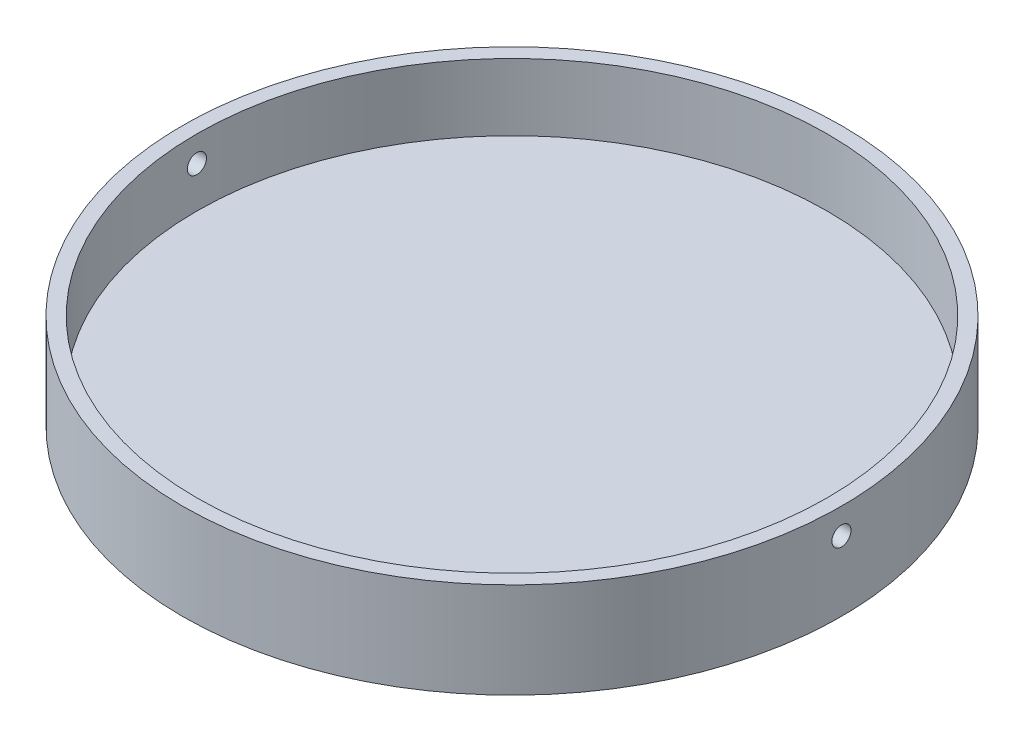
ISO-10303-21;
HEADER;
FILE_DESCRIPTION(('STEP AP214'),'2;1');
FILE_NAME('part.step','',(''),(''),'','','');
FILE_SCHEMA(('AUTOMOTIVE_DESIGN { 1 0 10303 214 1 1 1 1 }'));
ENDSEC;
DATA;
#1=APPLICATION_CONTEXT('core data for automotive mechanical design processes');
#2=APPLICATION_PROTOCOL_DEFINITION('international standard','automotive_design',2000,#1);
#3=PRODUCT_CONTEXT('',#1,'mechanical');
#4=PRODUCT('Part','Part','',(#3));
#5=PRODUCT_RELATED_PRODUCT_CATEGORY('part','',(#4));
#6=PRODUCT_DEFINITION_FORMATION('','',#4);
#7=PRODUCT_DEFINITION_CONTEXT('part definition',#1,'design');
#8=PRODUCT_DEFINITION('design','',#6,#7);
#9=PRODUCT_DEFINITION_SHAPE('','',#8);
#10=(LENGTH_UNIT() NAMED_UNIT(*) SI_UNIT(.MILLI.,.METRE.));
#11=(NAMED_UNIT(*) PLANE_ANGLE_UNIT() SI_UNIT($,.RADIAN.));
#12=(NAMED_UNIT(*) SI_UNIT($,.STERADIAN.) SOLID_ANGLE_UNIT());
#13=UNCERTAINTY_MEASURE_WITH_UNIT(LENGTH_MEASURE(1.E-05),#10,'distance_accuracy_value','');
#14=(GEOMETRIC_REPRESENTATION_CONTEXT(3) GLOBAL_UNCERTAINTY_ASSIGNED_CONTEXT((#13)) GLOBAL_UNIT_ASSIGNED_CONTEXT((#10,
#11,#12)) REPRESENTATION_CONTEXT('',''));
#15=CARTESIAN_POINT('',(0.,0.,0.));
#16=DIRECTION('',(0.,0.,1.));
#17=DIRECTION('',(1.,0.,0.));
#18=AXIS2_PLACEMENT_3D('',#15,#16,#17);
#19=CARTESIAN_POINT('',(0.,10.,0.));
#20=DIRECTION('',(0.,-1.,0.));
#21=DIRECTION('',(0.,0.,-1.));
#22=AXIS2_PLACEMENT_3D('',#19,#20,#21);
#23=CYLINDRICAL_SURFACE('',#22,34.5);
#24=CARTESIAN_POINT('',(0.,10.,0.));
#25=DIRECTION('',(0.,1.,0.));
#26=DIRECTION('',(0.,0.,1.));
#27=AXIS2_PLACEMENT_3D('',#24,#25,#26);
#28=CIRCLE('',#27,34.5);
#29=CARTESIAN_POINT('',(0.,10.,34.5));
#30=VERTEX_POINT('',#29);
#31=EDGE_CURVE('E10',#30,#30,#28,.T.);
#32=ORIENTED_EDGE('',*,*,#31,.F.);
#33=EDGE_LOOP('',(#32));
#34=FACE_BOUND('',#33,.T.);
#35=CARTESIAN_POINT('',(0.,0.,0.));
#36=DIRECTION('',(0.,1.,0.));
#37=DIRECTION('',(0.,0.,1.));
#38=AXIS2_PLACEMENT_3D('',#35,#36,#37);
#39=CIRCLE('',#38,34.5);
#40=CARTESIAN_POINT('',(0.,0.,34.5));
#41=VERTEX_POINT('',#40);
#42=EDGE_CURVE('E47',#41,#41,#39,.T.);
#43=ORIENTED_EDGE('',*,*,#42,.T.);
#44=EDGE_LOOP('',(#43));
#45=FACE_BOUND('',#44,.T.);
#46=CARTESIAN_POINT('',(34.5,6.30000000000002,0.));
#47=CARTESIAN_POINT('',(34.4999998046945,6.30000248649187,-0.0561577845511465));
#48=CARTESIAN_POINT('',(34.4998614117132,6.30474642336289,-0.112355988488296));
#49=CARTESIAN_POINT('',(34.4993226388949,6.32360461180538,-0.223203800673478));
#50=CARTESIAN_POINT('',(34.4989219459619,6.33773006197835,-0.277851476685632));
#51=CARTESIAN_POINT('',(34.4979039516065,6.37494804146932,-0.38397634150455));
#52=CARTESIAN_POINT('',(34.4972867559949,6.39803619105604,-0.435455064645263));
#53=CARTESIAN_POINT('',(34.4959053786316,6.4525179175079,-0.53379158758923));
#54=CARTESIAN_POINT('',(34.495141232818,6.48390946439989,-0.580650512979203));
#55=CARTESIAN_POINT('',(34.4935516278935,6.55412298566468,-0.6684521142079));
#56=CARTESIAN_POINT('',(34.4927261463915,6.59294768178979,-0.709392613264135));
#57=CARTESIAN_POINT('',(34.4911071048998,6.67692073158166,-0.784176923872428));
#58=CARTESIAN_POINT('',(34.4903135461813,6.72206933674449,-0.818020453050759));
#59=CARTESIAN_POINT('',(34.4888477313474,6.81741637750982,-0.877653292042605));
#60=CARTESIAN_POINT('',(34.4881754943653,6.86761560769315,-0.903441331912479));
#61=CARTESIAN_POINT('',(34.4870283277185,6.97163325402746,-0.946222882372556));
#62=CARTESIAN_POINT('',(34.4865533972886,7.02545165614172,-0.963216427069379));
#63=CARTESIAN_POINT('',(34.4858545550434,7.1351638378897,-0.987922024237621));
#64=CARTESIAN_POINT('',(34.485630572269,7.19105702622539,-0.995636700495366));
#65=CARTESIAN_POINT('',(34.4854586667784,7.30334555156083,-1.00157365007413));
#66=CARTESIAN_POINT('',(34.4855107430004,7.35974088662834,-0.999795959905588));
#67=CARTESIAN_POINT('',(34.4858850168782,7.47141504675166,-0.986800862487214));
#68=CARTESIAN_POINT('',(34.4862071333257,7.52669420235532,-0.975586293158666));
#69=CARTESIAN_POINT('',(34.4870850474834,7.63458492146474,-0.944040166641229));
#70=CARTESIAN_POINT('',(34.4876408456903,7.68719647930073,-0.923708590075785));
#71=CARTESIAN_POINT('',(34.488923561906,7.78826766974962,-0.874502332981568));
#72=CARTESIAN_POINT('',(34.4896505059684,7.83672666868263,-0.845626351561111));
#73=CARTESIAN_POINT('',(34.4911935375142,7.92811020750982,-0.780151939554365));
#74=CARTESIAN_POINT('',(34.4920096251853,7.97103473574799,-0.74355349270439));
#75=CARTESIAN_POINT('',(34.4936393074267,8.05014739777088,-0.663656990410169));
#76=CARTESIAN_POINT('',(34.4944529009686,8.08633304585002,-0.62035647357953));
#77=CARTESIAN_POINT('',(34.4959855877378,8.15092162658219,-0.52829366358104));
#78=CARTESIAN_POINT('',(34.49670468095,8.17932455799251,-0.479531369541086));
#79=CARTESIAN_POINT('',(34.4979673143515,8.22754116455228,-0.377927819396129));
#80=CARTESIAN_POINT('',(34.4985108529508,8.24735476191287,-0.325086526354983));
#81=CARTESIAN_POINT('',(34.4993610799481,8.2778286756748,-0.21682558057597));
#82=CARTESIAN_POINT('',(34.4996677689487,8.28848901536249,-0.161405934397941));
#83=CARTESIAN_POINT('',(34.5000096480394,8.30035075893756,-0.0495830524630798));
#84=CARTESIAN_POINT('',(34.500044936846,8.30155560208144,0.00681981818250436));
#85=CARTESIAN_POINT('',(34.4998402990692,8.29448111337462,0.119027035379701));
#86=CARTESIAN_POINT('',(34.4996003727826,8.28620179175481,0.174831382576897));
#87=CARTESIAN_POINT('',(34.4988724091248,8.260396840784,0.284247874070394));
#88=CARTESIAN_POINT('',(34.4983844136463,8.24287277262259,0.337860386862064));
#89=CARTESIAN_POINT('',(34.4972153032426,8.19907736036927,0.44138264812218));
#90=CARTESIAN_POINT('',(34.496534187957,8.17280599995106,0.491292389679408));
#91=CARTESIAN_POINT('',(34.4950553247578,8.11225289783428,0.586008177135157));
#92=CARTESIAN_POINT('',(34.4942575431649,8.07796884129803,0.630812742592857));
#93=CARTESIAN_POINT('',(34.4926353717158,8.00236694731424,0.714031468813746));
#94=CARTESIAN_POINT('',(34.4918109817955,7.9610490929013,0.752445614162921));
#95=CARTESIAN_POINT('',(34.4902282491819,7.87253773503847,0.82180453692617));
#96=CARTESIAN_POINT('',(34.4894699261552,7.82534249211954,0.852747095051693));
#97=CARTESIAN_POINT('',(34.488105134619,7.72642494851932,0.906269317304904));
#98=CARTESIAN_POINT('',(34.4874986657796,7.67470265767701,0.928848999607708));
#99=CARTESIAN_POINT('',(34.4865061010906,7.56820758571198,0.965000629858153));
#100=CARTESIAN_POINT('',(34.4861199700853,7.51343529275906,0.978574014847635));
#101=CARTESIAN_POINT('',(34.4856115175684,7.40238807570962,0.996332463932852));
#102=CARTESIAN_POINT('',(34.4854891958718,7.34611315266714,1.00051753461394));
#103=CARTESIAN_POINT('',(34.4855221661644,7.23368035133098,0.999380387266016));
#104=CARTESIAN_POINT('',(34.4856773559069,7.17752243755813,0.994061670831818));
#105=CARTESIAN_POINT('',(34.4862476393613,7.06689698260672,0.974075126050981));
#106=CARTESIAN_POINT('',(34.486662733589,7.01242944478301,0.959407279150584));
#107=CARTESIAN_POINT('',(34.4877060172622,6.90672947354561,0.921139296053091));
#108=CARTESIAN_POINT('',(34.4883342103099,6.8554970948349,0.897539008865471));
#109=CARTESIAN_POINT('',(34.4897328468125,6.75772282262835,0.842077347897055));
#110=CARTESIAN_POINT('',(34.4905032850938,6.71118075862996,0.810216274563292));
#111=CARTESIAN_POINT('',(34.4920998413686,6.6240923518436,0.739127423656141));
#112=CARTESIAN_POINT('',(34.4929259738919,6.58354758253188,0.699897718922836));
#113=CARTESIAN_POINT('',(34.4945408498475,6.50960844468429,0.615176895547693));
#114=CARTESIAN_POINT('',(34.4953295839687,6.47621584961193,0.569684228515873));
#115=CARTESIAN_POINT('',(34.496781015048,6.41752364536506,0.473711713627784));
#116=CARTESIAN_POINT('',(34.497443631422,6.39222920358373,0.42322870823813));
#117=CARTESIAN_POINT('',(34.4985666770347,6.35050439933714,0.318769636078153));
#118=CARTESIAN_POINT('',(34.4990273473385,6.33406346296609,0.264797822771157));
#119=CARTESIAN_POINT('',(34.4995714248457,6.31487101549548,0.175404064473235));
#120=CARTESIAN_POINT('',(34.4997314435224,6.30930139780287,0.140562398656607));
#121=CARTESIAN_POINT('',(34.4999457923827,6.30186511016429,0.070485797185735));
#122=CARTESIAN_POINT('',(34.5000001225954,6.29999843920162,0.0352508616394729));
#123=CARTESIAN_POINT('',(34.5,6.30000000000002,0.));
#124=B_SPLINE_CURVE_WITH_KNOTS('',3,(#46,#47,#48,#49,#50,#51,#52,#53,#54,#55,#56,#57,#58,#59,
#60,#61,#62,#63,#64,#65,#66,#67,#68,#69,#70,#71,#72,#73,#74,#75,#76,#77,#78,#79,#80,#81,#82,#83,
#84,#85,#86,#87,#88,#89,#90,#91,#92,#93,#94,#95,#96,#97,#98,#99,#100,#101,#102,#103,#104,#105,
#106,#107,#108,#109,#110,#111,#112,#113,#114,#115,#116,#117,#118,#119,#120,#121,#122,#123),
.UNSPECIFIED.,.T.,.F.,(4,2,2,2,2,2,2,2,2,2,2,2,2,2,2,2,2,2,2,2,2,2,2,2,2,2,2,2,2,2,2,2,2,2,2,2,
2,2,4),(0.,0.168344683735104,0.336890680567464,0.505354418831559,0.673777009926029,
0.842261389681646,1.01075247181021,1.17927010307896,1.3477870808014,1.51625639575398,
1.68472506272425,1.85314308477081,2.02156146476122,2.19000549977429,2.35844988953782,
2.52695628922152,2.6954627158113,2.86397066843907,3.03247819237284,3.20092442206684,
3.36937047005223,3.53778808112234,3.70620600653575,3.87467264752724,4.04313969486281,
4.2116567206476,4.3801733801906,4.54866314480069,4.71715279122499,4.88558037177809,
5.05400828658412,5.22243904855781,5.39086368551809,5.55933243301633,5.72784290603201,
5.89646069145883,6.06487664436631,6.17054849076994,6.27622030815943),.UNSPECIFIED.);
#125=CARTESIAN_POINT('',(34.5,6.30000000000002,0.));
#126=VERTEX_POINT('',#125);
#127=EDGE_CURVE('E82',#126,#126,#124,.T.);
#128=ORIENTED_EDGE('',*,*,#127,.F.);
#129=EDGE_LOOP('',(#128));
#130=FACE_BOUND('',#129,.T.);
#131=CARTESIAN_POINT('',(-34.4855042010408,7.30000000000002,1.));
#132=CARTESIAN_POINT('',(-34.4855043966615,7.35615777896248,0.999997513503064));
#133=CARTESIAN_POINT('',(-34.4856428493906,7.41235597733022,0.995253577544319));
#134=CARTESIAN_POINT('',(-34.4861818354653,7.52320377794335,0.97639539305499));
#135=CARTESIAN_POINT('',(-34.4865826820198,7.5778514479485,0.962269945904057));
#136=CARTESIAN_POINT('',(-34.4876010099077,7.68397630007032,0.925051975255354));
#137=CARTESIAN_POINT('',(-34.488218385414,7.73545501657182,0.901963831633155));
#138=CARTESIAN_POINT('',(-34.4896000699939,7.83379152841197,0.847482119223123));
#139=CARTESIAN_POINT('',(-34.4903643431426,7.8806504493289,0.816090580393597));
#140=CARTESIAN_POINT('',(-34.4919540947383,7.96845205569152,0.745877067238504));
#141=CARTESIAN_POINT('',(-34.4927795955512,8.00939256291806,0.707052369362862));
#142=CARTESIAN_POINT('',(-34.4943985588806,8.08417688927162,0.623079312650367));
#143=CARTESIAN_POINT('',(-34.4951920201214,8.11802042604993,0.577930702339597));
#144=CARTESIAN_POINT('',(-34.4966575658427,8.17765327292448,0.482583657146451));
#145=CARTESIAN_POINT('',(-34.4973296311994,8.20344131449091,0.432384428567677));
#146=CARTESIAN_POINT('',(-34.4984764557693,8.24622286853152,0.32836678572263));
#147=CARTESIAN_POINT('',(-34.4989512157472,8.26321641509164,0.274548385484554));
#148=CARTESIAN_POINT('',(-34.4996497931078,8.28792201624922,0.164836209146201));
#149=CARTESIAN_POINT('',(-34.4998736814319,8.29563669476316,0.108943024373051));
#150=CARTESIAN_POINT('',(-34.500045515344,8.30157365008834,-0.0033454940118148));
#151=CARTESIAN_POINT('',(-34.4999934619926,8.29979596338633,-0.0597408256925462));
#152=CARTESIAN_POINT('',(-34.4996193411484,8.28680087138632,-0.17141500129149));
#153=CARTESIAN_POINT('',(-34.499297354732,8.27558630052198,-0.226694175350868));
#154=CARTESIAN_POINT('',(-34.498419750732,8.24404016450828,-0.334584930580967));
#155=CARTESIAN_POINT('',(-34.4978641326528,8.22370858001649,-0.387196506091914));
#156=CARTESIAN_POINT('',(-34.4965817481125,8.1745023066555,-0.488267717694181));
#157=CARTESIAN_POINT('',(-34.4958549556308,8.14562631876796,-0.536726721018085));
#158=CARTESIAN_POINT('',(-34.4943121321187,8.08015189303604,-0.628110265870448));
#159=CARTESIAN_POINT('',(-34.4934961009003,8.04355343892378,-0.671034795739863));
#160=CARTESIAN_POINT('',(-34.4918664119504,7.96365693156341,-0.750147449298961));
#161=CARTESIAN_POINT('',(-34.4910527552027,7.92035641838948,-0.786333088756667));
#162=CARTESIAN_POINT('',(-34.4895198497781,7.82829361874798,-0.850921653848826));
#163=CARTESIAN_POINT('',(-34.4888006011164,7.77953133139624,-0.879324578223405));
#164=CARTESIAN_POINT('',(-34.4875376326048,7.67792778287988,-0.927541179752248));
#165=CARTESIAN_POINT('',(-34.4869939143894,7.62508648373253,-0.947354776913501));
#166=CARTESIAN_POINT('',(-34.4861433828903,7.51682552470884,-0.977828688397576));
#167=CARTESIAN_POINT('',(-34.4858365690029,7.46140587140247,-0.988489026042695));
#168=CARTESIAN_POINT('',(-34.4854945497825,7.34958298644503,-1.00035076194403));
#169=CARTESIAN_POINT('',(-34.4854592456373,7.29318012011198,-1.00155560140443));
#170=CARTESIAN_POINT('',(-34.4856639688218,7.1809729124311,-0.994481106870726));
#171=CARTESIAN_POINT('',(-34.4859039958546,7.12516857043772,-0.986201783107063));
#172=CARTESIAN_POINT('',(-34.4866322329101,7.01575210334837,-0.960396833025402));
#173=CARTESIAN_POINT('',(-34.4871204009699,6.9621396092462,-0.942872770060039));
#174=CARTESIAN_POINT('',(-34.4882898527511,6.85861738305792,-0.899077374476204));
#175=CARTESIAN_POINT('',(-34.4889711368336,6.80870765789587,-0.872806025501125));
#176=CARTESIAN_POINT('',(-34.4904502602827,6.71399188115795,-0.812252939968673));
#177=CARTESIAN_POINT('',(-34.4912481333486,6.66918731188499,-0.777968885661196));
#178=CARTESIAN_POINT('',(-34.4928703700141,6.58596857692419,-0.702366993994283));
#179=CARTESIAN_POINT('',(-34.4936947336776,6.54755442663419,-0.661049139687255));
#180=CARTESIAN_POINT('',(-34.4952773075883,6.47819549383851,-0.572537779576498));
#181=CARTESIAN_POINT('',(-34.4960354981375,6.44725293062158,-0.525342534302819));
#182=CARTESIAN_POINT('',(-34.4973999764848,6.39373069942092,-0.426424984696161));
#183=CARTESIAN_POINT('',(-34.498006264613,6.37115101326211,-0.374702690202134));
#184=CARTESIAN_POINT('',(-34.4989984988728,6.33499938031514,-0.268207621065989));
#185=CARTESIAN_POINT('',(-34.4993844801959,6.32142599481887,-0.213435335159568));
#186=CARTESIAN_POINT('',(-34.4998927300556,6.30366754233012,-0.102388132919097));
#187=CARTESIAN_POINT('',(-34.5000149987761,6.29948246878951,-0.046113217633124));
#188=CARTESIAN_POINT('',(-34.4999820425492,6.30061960807283,0.0663195891326281));
#189=CARTESIAN_POINT('',(-34.4998269197054,6.30593832269522,0.122477516056885));
#190=CARTESIAN_POINT('',(-34.4992568604314,6.32592486849218,0.233102997746688));
#191=CARTESIAN_POINT('',(-34.4988419234863,6.34059271819682,0.287570549161669));
#192=CARTESIAN_POINT('',(-34.4977989759251,6.3788607117224,0.393270546659575));
#193=CARTESIAN_POINT('',(-34.4971709617078,6.40246100651514,0.444502938046334));
#194=CARTESIAN_POINT('',(-34.4957726260003,6.45792268659465,0.542277232411385));
#195=CARTESIAN_POINT('',(-34.4950023096864,6.48978377142078,0.588819305899976));
#196=CARTESIAN_POINT('',(-34.4934058874433,6.56087263466112,0.675907711399699));
#197=CARTESIAN_POINT('',(-34.4925797669753,6.60010233762951,0.716452472061236));
#198=CARTESIAN_POINT('',(-34.490964799574,6.68482315395909,0.790391593284049));
#199=CARTESIAN_POINT('',(-34.4901759619232,6.73031581572885,0.823784180359634));
#200=CARTESIAN_POINT('',(-34.4887242534084,6.82628832664579,0.882476376347583));
#201=CARTESIAN_POINT('',(-34.4880614631077,6.8767713342606,0.90777081633666));
#202=CARTESIAN_POINT('',(-34.48693807595,6.9812304111986,0.9494956166088));
#203=CARTESIAN_POINT('',(-34.48647723802,7.03520222704638,0.965936550826577));
#204=CARTESIAN_POINT('',(-34.4859329520411,7.12459597955062,0.985128992009054));
#205=CARTESIAN_POINT('',(-34.4857728685457,7.15943763658893,0.990698606879123));
#206=CARTESIAN_POINT('',(-34.4855584316634,7.22951422045825,0.998134890766206));
#207=CARTESIAN_POINT('',(-34.4855040782475,7.26474914718113,1.00000156080136));
#208=CARTESIAN_POINT('',(-34.4855042010408,7.30000000000002,1.));
#209=B_SPLINE_CURVE_WITH_KNOTS('',3,(#131,#132,#133,#134,#135,#136,#137,#138,#139,#140,#141,
#142,#143,#144,#145,#146,#147,#148,#149,#150,#151,#152,#153,#154,#155,#156,#157,#158,#159,#160,
#161,#162,#163,#164,#165,#166,#167,#168,#169,#170,#171,#172,#173,#174,#175,#176,#177,#178,#179,
#180,#181,#182,#183,#184,#185,#186,#187,#188,#189,#190,#191,#192,#193,#194,#195,#196,#197,#198,
#199,#200,#201,#202,#203,#204,#205,#206,#207,#208),.UNSPECIFIED.,.T.,.F.,(4,2,2,2,2,2,2,2,2,2,2,
2,2,2,2,2,2,2,2,2,2,2,2,2,2,2,2,2,2,2,2,2,2,2,2,2,2,2,4),(0.,0.168344666951775,
0.336890647365465,0.505354366485287,0.673776938730269,0.842261340438658,1.01075244392666,
1.17927006699606,1.34778703691533,1.51625634169998,1.68472499892274,1.85314307346897,
2.02156150532853,2.19000555525971,2.35844996003302,2.52695633794915,2.69546274314326,
2.86397071761571,3.03247826273241,3.20092447889963,3.36937051336653,3.53778807151075,
3.70620594458181,3.87467259452731,4.04313965039056,4.21165668471111,4.38017335279086,
4.5486630947539,4.71715271919924,4.88558033792177,5.05400829047055,5.22243908983314,
5.39086376390643,5.55933248888089,5.7278429398922,5.89646073509569,6.06487669722301,
6.17054851720683,6.27622030813588),.UNSPECIFIED.);
#210=CARTESIAN_POINT('',(-34.4855042010408,7.30000000000002,1.));
#211=VERTEX_POINT('',#210);
#212=EDGE_CURVE('E77',#211,#211,#209,.T.);
#213=ORIENTED_EDGE('',*,*,#212,.F.);
#214=EDGE_LOOP('',(#213));
#215=FACE_BOUND('',#214,.T.);
#216=ADVANCED_FACE('F35',(#34,#45,#130,#215),#23,.T.);
#217=CARTESIAN_POINT('',(0.,3.00000000000001,0.));
#218=DIRECTION('',(0.,1.,0.));
#219=DIRECTION('',(0.,0.,1.));
#220=AXIS2_PLACEMENT_3D('',#217,#218,#219);
#221=CYLINDRICAL_SURFACE('',#220,33.);
#222=CARTESIAN_POINT('',(0.,3.00000000000001,0.));
#223=DIRECTION('',(0.,1.,0.));
#224=DIRECTION('',(0.,0.,1.));
#225=AXIS2_PLACEMENT_3D('',#222,#223,#224);
#226=CIRCLE('',#225,33.);
#227=CARTESIAN_POINT('',(0.,3.00000000000001,33.));
#228=VERTEX_POINT('',#227);
#229=EDGE_CURVE('E52',#228,#228,#226,.T.);
#230=ORIENTED_EDGE('',*,*,#229,.F.);
#231=EDGE_LOOP('',(#230));
#232=FACE_BOUND('',#231,.T.);
#233=CARTESIAN_POINT('',(0.,10.,0.));
#234=DIRECTION('',(0.,1.,0.));
#235=DIRECTION('',(0.,0.,1.));
#236=AXIS2_PLACEMENT_3D('',#233,#234,#235);
#237=CIRCLE('',#236,33.);
#238=CARTESIAN_POINT('',(0.,10.,33.));
#239=VERTEX_POINT('',#238);
#240=EDGE_CURVE('E55',#239,#239,#237,.T.);
#241=ORIENTED_EDGE('',*,*,#240,.T.);
#242=EDGE_LOOP('',(#241));
#243=FACE_BOUND('',#242,.T.);
#244=CARTESIAN_POINT('',(-32.9848450049413,7.30000000000002,1.));
#245=CARTESIAN_POINT('',(-32.9848452094151,7.24384339825292,0.999997513916846));
#246=CARTESIAN_POINT('',(-32.984989955123,7.18764640587518,0.995253776058183));
#247=CARTESIAN_POINT('',(-32.985553437433,7.07680106479074,0.976396424324178));
#248=CARTESIAN_POINT('',(-32.9859725012603,7.02215464704196,0.96227161978723));
#249=CARTESIAN_POINT('',(-32.9870371050102,6.91603230583989,0.925055456478256));
#250=CARTESIAN_POINT('',(-32.9876825340706,6.86455484487384,0.901968486328517));
#251=CARTESIAN_POINT('',(-32.9891269996576,6.76622059517838,0.847489644729131));
#252=CARTESIAN_POINT('',(-32.9899259986878,6.71936268274141,0.816099799834387));
#253=CARTESIAN_POINT('',(-32.9915880050526,6.6315615674128,0.745889243499292));
#254=CARTESIAN_POINT('',(-32.992451037325,6.59062068740648,0.707065627568262));
#255=CARTESIAN_POINT('',(-32.9941436132942,6.51583534527425,0.623094670175425));
#256=CARTESIAN_POINT('',(-32.994973155656,6.48199116582775,0.57794707693314));
#257=CARTESIAN_POINT('',(-32.9965053674752,6.42235625474849,0.482601050206226));
#258=CARTESIAN_POINT('',(-32.9972080148601,6.3965669236343,0.432401740369788));
#259=CARTESIAN_POINT('',(-32.998407035057,6.35378288884311,0.328383501204769));
#260=CARTESIAN_POINT('',(-32.9989034087043,6.3367881495537,0.274564586534249));
#261=CARTESIAN_POINT('',(-32.9996337921232,6.31208073029941,0.164852473100316));
#262=CARTESIAN_POINT('',(-32.9998678829986,6.30436518094284,0.108959921079048));
#263=CARTESIAN_POINT('',(-33.0000475851029,6.29842631804303,-0.00332752322261688));
#264=CARTESIAN_POINT('',(-32.9999931974955,6.30020296621305,-0.0597224134759168));
#265=CARTESIAN_POINT('',(-32.999602142838,6.31319564237434,-0.171394249637361));
#266=CARTESIAN_POINT('',(-32.999265568437,6.32440857219892,-0.226671556376913));
#267=CARTESIAN_POINT('',(-32.9983481795469,6.35595072504194,-0.334558852911754));
#268=CARTESIAN_POINT('',(-32.9977673645154,6.37627996829927,-0.387168836785096));
#269=CARTESIAN_POINT('',(-32.9964267952727,6.42548122697416,-0.488238040766675));
#270=CARTESIAN_POINT('',(-32.9956670113311,6.45435466195565,-0.536696569410087));
#271=CARTESIAN_POINT('',(-32.9940541292464,6.51982363516501,-0.628079714022284));
#272=CARTESIAN_POINT('',(-32.993201030885,6.5564191914623,-0.67100431704155));
#273=CARTESIAN_POINT('',(-32.9914972555386,6.63631113021747,-0.750119200807011));
#274=CARTESIAN_POINT('',(-32.9906465796652,6.67961020121639,-0.786306766685399));
#275=CARTESIAN_POINT('',(-32.9890439003924,6.7716705811351,-0.850899438716022));
#276=CARTESIAN_POINT('',(-32.9882918970094,6.82043189095892,-0.879304543580198));
#277=CARTESIAN_POINT('',(-32.9869713806257,6.92203411368124,-0.927525677221475));
#278=CARTESIAN_POINT('',(-32.9864028695078,6.97487506843368,-0.947341617866715));
#279=CARTESIAN_POINT('',(-32.9855135199283,7.08313591855157,-0.977820170080306));
#280=CARTESIAN_POINT('',(-32.9851926807778,7.1385558067441,-0.988482807105594));
#281=CARTESIAN_POINT('',(-32.9848349761178,7.25037772812721,-1.00034874629295));
#282=CARTESIAN_POINT('',(-32.9847979976982,7.30677936186436,-1.00155580956432));
#283=CARTESIAN_POINT('',(-32.9850118894533,7.4189844723917,-0.994486138389986));
#284=CARTESIAN_POINT('',(-32.9852627592874,7.47478794988961,-0.986209415166506));
#285=CARTESIAN_POINT('',(-32.9860239641499,7.5842021866354,-0.960410233012218));
#286=CARTESIAN_POINT('',(-32.9865342512087,7.63781334929017,-0.942889483394619));
#287=CARTESIAN_POINT('',(-32.9877567251355,7.74133350930821,-0.89910133437196));
#288=CARTESIAN_POINT('',(-32.9884689124185,7.79124249906215,-0.872833916989885));
#289=CARTESIAN_POINT('',(-32.9900151778128,7.88595889683607,-0.812288379163003));
#290=CARTESIAN_POINT('',(-32.9908492944343,7.93076468507472,-0.77800772575758));
#291=CARTESIAN_POINT('',(-32.9925452517959,8.01398653388911,-0.702412538591519));
#292=CARTESIAN_POINT('',(-32.9934070926079,8.05240257787503,-0.661097986569185));
#293=CARTESIAN_POINT('',(-32.9950616715456,8.12176699374119,-0.572591666512515));
#294=CARTESIAN_POINT('',(-32.9958543871723,8.15271293998114,-0.525397996971732));
#295=CARTESIAN_POINT('',(-32.9972810356506,8.20624212879056,-0.426482807563423));
#296=CARTESIAN_POINT('',(-32.9979149688637,8.2288253903995,-0.374761298004851));
#297=CARTESIAN_POINT('',(-32.9989524843327,8.26498390147263,-0.268267757417567));
#298=CARTESIAN_POINT('',(-32.9993561067704,8.27856072233616,-0.213496260344184));
#299=CARTESIAN_POINT('',(-32.999887661619,8.29632610964994,-0.102449938949434));
#300=CARTESIAN_POINT('',(-33.0000155942863,8.30051468483106,-0.0461751160261765));
#301=CARTESIAN_POINT('',(-32.9999813508045,8.2993845006457,0.0662561625748287));
#302=CARTESIAN_POINT('',(-32.9998192912732,8.29406956302972,0.122412656745657));
#303=CARTESIAN_POINT('',(-32.9992235528111,8.27409108466653,0.233035883636807));
#304=CARTESIAN_POINT('',(-32.998789873343,8.25942752542208,0.287502613013525));
#305=CARTESIAN_POINT('',(-32.9976997432227,8.22116857937609,0.393201647748674));
#306=CARTESIAN_POINT('',(-32.9970432888647,8.19757304399322,0.444433899285776));
#307=CARTESIAN_POINT('',(-32.9955815732978,8.14212123853,0.54220879356863));
#308=CARTESIAN_POINT('',(-32.9947763174615,8.11026526668049,0.588751605535427));
#309=CARTESIAN_POINT('',(-32.9931074026415,8.03918555727258,0.675844039137156));
#310=CARTESIAN_POINT('',(-32.9922437264673,7.99995964498123,0.716391885441771));
#311=CARTESIAN_POINT('',(-32.9905552857636,7.91524584696166,0.790337856052523));
#312=CARTESIAN_POINT('',(-32.9897305309215,7.86975641318205,0.823734207611379));
#313=CARTESIAN_POINT('',(-32.9882126523462,7.77378883908226,0.882434983782636));
#314=CARTESIAN_POINT('',(-32.9875196147845,7.72330746555596,0.907734118414881));
#315=CARTESIAN_POINT('',(-32.9863448968476,7.61885060111022,0.949468459862879));
#316=CARTESIAN_POINT('',(-32.98586296459,7.56487936292557,0.96591423554956));
#317=CARTESIAN_POINT('',(-32.9852936137897,7.47547271891875,0.985117254893504));
#318=CARTESIAN_POINT('',(-32.9851261164718,7.44061762048011,0.990691260658938));
#319=CARTESIAN_POINT('',(-32.9849017478623,7.37051365728703,0.998133413249859));
#320=CARTESIAN_POINT('',(-32.9848448765374,7.33526479265119,1.00000156119146));
#321=CARTESIAN_POINT('',(-32.9848450049413,7.30000000000002,1.));
#322=B_SPLINE_CURVE_WITH_KNOTS('',3,(#244,#245,#246,#247,#248,#249,#250,#251,#252,#253,#254,
#255,#256,#257,#258,#259,#260,#261,#262,#263,#264,#265,#266,#267,#268,#269,#270,#271,#272,#273,
#274,#275,#276,#277,#278,#279,#280,#281,#282,#283,#284,#285,#286,#287,#288,#289,#290,#291,#292,
#293,#294,#295,#296,#297,#298,#299,#300,#301,#302,#303,#304,#305,#306,#307,#308,#309,#310,#311,
#312,#313,#314,#315,#316,#317,#318,#319,#320,#321),.UNSPECIFIED.,.T.,.F.,(4,2,2,2,2,2,2,2,2,2,2,
2,2,2,2,2,2,2,2,2,2,2,2,2,2,2,2,2,2,2,2,2,2,2,2,2,2,2,4),(0.,0.168341084003358,
0.336883343407829,0.505343174391838,0.673761925799804,0.842246615823596,1.01073801574169,
1.17925869543352,1.34777869272,1.51624656537945,1.68471375852474,1.85312566125722,
2.02153793787864,2.1899782108697,2.35841887800788,2.52692727654634,2.69543570297426,
2.86394585839576,3.03245554515955,3.20089820103071,3.36934065758267,3.53775197834513,
3.70616364524528,3.87462861874332,4.04309402962369,4.21161407010399,4.38013372690912,
4.54862397349753,4.71711406339367,4.88553641178359,5.05395909341607,5.22238457684377,
5.39080398036544,5.55927315960984,5.72778405159506,5.89640480950997,6.0648238241834,
6.17053740059808,6.2762509451745),.UNSPECIFIED.);
#323=CARTESIAN_POINT('',(-32.9848450049413,7.30000000000002,1.));
#324=VERTEX_POINT('',#323);
#325=EDGE_CURVE('E57',#324,#324,#322,.T.);
#326=ORIENTED_EDGE('',*,*,#325,.F.);
#327=EDGE_LOOP('',(#326));
#328=FACE_BOUND('',#327,.T.);
#329=CARTESIAN_POINT('',(32.9848450049413,7.30000000000002,1.));
#330=CARTESIAN_POINT('',(32.9848452094151,7.35615660174711,0.999997513916846));
#331=CARTESIAN_POINT('',(32.984989955123,7.41235359412485,0.995253776058183));
#332=CARTESIAN_POINT('',(32.985553437433,7.5231989352093,0.976396424324178));
#333=CARTESIAN_POINT('',(32.9859725012603,7.57784535295808,0.96227161978723));
#334=CARTESIAN_POINT('',(32.9870371050102,7.68396769416014,0.925055456478257));
#335=CARTESIAN_POINT('',(32.9876825340706,7.73544515512619,0.901968486328518));
#336=CARTESIAN_POINT('',(32.9891269996576,7.83377940482166,0.847489644729132));
#337=CARTESIAN_POINT('',(32.9899259986878,7.88063731725863,0.816099799834387));
#338=CARTESIAN_POINT('',(32.9915880050526,7.96843843258723,0.745889243499292));
#339=CARTESIAN_POINT('',(32.992451037325,8.00937931259355,0.707065627568263));
#340=CARTESIAN_POINT('',(32.9941436132942,8.08416465472578,0.623094670175425));
#341=CARTESIAN_POINT('',(32.994973155656,8.11800883417228,0.57794707693314));
#342=CARTESIAN_POINT('',(32.9965053674752,8.17764374525154,0.482601050206225));
#343=CARTESIAN_POINT('',(32.9972080148601,8.20343307636574,0.432401740369788));
#344=CARTESIAN_POINT('',(32.998407035057,8.24621711115692,0.328383501204769));
#345=CARTESIAN_POINT('',(32.9989034087043,8.26321185044633,0.274564586534249));
#346=CARTESIAN_POINT('',(32.9996337921232,8.28791926970062,0.164852473100317));
#347=CARTESIAN_POINT('',(32.9998678829986,8.29563481905719,0.108959921079048));
#348=CARTESIAN_POINT('',(33.0000475851029,8.301573681957,-0.00332752322261652));
#349=CARTESIAN_POINT('',(32.9999931974955,8.29979703378698,-0.0597224134759165));
#350=CARTESIAN_POINT('',(32.999602142838,8.28680435762569,-0.17139424963736));
#351=CARTESIAN_POINT('',(32.999265568437,8.27559142780111,-0.226671556376913));
#352=CARTESIAN_POINT('',(32.9983481795469,8.2440492749581,-0.334558852911754));
#353=CARTESIAN_POINT('',(32.9977673645154,8.22372003170077,-0.387168836785096));
#354=CARTESIAN_POINT('',(32.9964267952727,8.17451877302588,-0.488238040766675));
#355=CARTESIAN_POINT('',(32.9956670113311,8.14564533804438,-0.536696569410087));
#356=CARTESIAN_POINT('',(32.9940541292464,8.08017636483502,-0.628079714022284));
#357=CARTESIAN_POINT('',(32.993201030885,8.04358080853773,-0.67100431704155));
#358=CARTESIAN_POINT('',(32.9914972555386,7.96368886978256,-0.750119200807011));
#359=CARTESIAN_POINT('',(32.9906465796652,7.92038979878364,-0.786306766685399));
#360=CARTESIAN_POINT('',(32.9890439003924,7.82832941886494,-0.850899438716022));
#361=CARTESIAN_POINT('',(32.9882918970094,7.77956810904111,-0.879304543580198));
#362=CARTESIAN_POINT('',(32.9869713806257,7.6779658863188,-0.927525677221475));
#363=CARTESIAN_POINT('',(32.9864028695078,7.62512493156635,-0.947341617866715));
#364=CARTESIAN_POINT('',(32.9855135199283,7.51686408144847,-0.977820170080306));
#365=CARTESIAN_POINT('',(32.9851926807778,7.46144419325594,-0.988482807105594));
#366=CARTESIAN_POINT('',(32.9848349761178,7.34962227187283,-1.00034874629295));
#367=CARTESIAN_POINT('',(32.9847979976982,7.29322063813567,-1.00155580956432));
#368=CARTESIAN_POINT('',(32.9850118894533,7.18101552760834,-0.994486138389986));
#369=CARTESIAN_POINT('',(32.9852627592874,7.12521205011043,-0.986209415166506));
#370=CARTESIAN_POINT('',(32.9860239641499,7.01579781336464,-0.960410233012218));
#371=CARTESIAN_POINT('',(32.9865342512087,6.96218665070986,-0.942889483394619));
#372=CARTESIAN_POINT('',(32.9877567251355,6.85866649069182,-0.89910133437196));
#373=CARTESIAN_POINT('',(32.9884689124185,6.80875750093788,-0.872833916989885));
#374=CARTESIAN_POINT('',(32.9900151778128,6.71404110316396,-0.812288379163003));
#375=CARTESIAN_POINT('',(32.9908492944343,6.66923531492531,-0.77800772575758));
#376=CARTESIAN_POINT('',(32.9925452517959,6.58601346611092,-0.702412538591519));
#377=CARTESIAN_POINT('',(32.9934070926079,6.547597422125,-0.661097986569185));
#378=CARTESIAN_POINT('',(32.9950616715456,6.47823300625885,-0.572591666512515));
#379=CARTESIAN_POINT('',(32.9958543871723,6.44728706001889,-0.525397996971732));
#380=CARTESIAN_POINT('',(32.9972810356506,6.39375787120947,-0.426482807563424));
#381=CARTESIAN_POINT('',(32.9979149688637,6.37117460960053,-0.374761298004851));
#382=CARTESIAN_POINT('',(32.9989524843327,6.3350160985274,-0.268267757417567));
#383=CARTESIAN_POINT('',(32.9993561067704,6.32143927766388,-0.213496260344184));
#384=CARTESIAN_POINT('',(32.999887661619,6.30367389035009,-0.102449938949434));
#385=CARTESIAN_POINT('',(33.0000155942863,6.29948531516898,-0.0461751160261764));
#386=CARTESIAN_POINT('',(32.9999813508045,6.30061549935433,0.0662561625748286));
#387=CARTESIAN_POINT('',(32.9998192912732,6.30593043697031,0.122412656745657));
#388=CARTESIAN_POINT('',(32.9992235528111,6.3259089153335,0.233035883636807));
#389=CARTESIAN_POINT('',(32.998789873343,6.34057247457795,0.287502613013525));
#390=CARTESIAN_POINT('',(32.9976997432227,6.37883142062394,0.393201647748674));
#391=CARTESIAN_POINT('',(32.9970432888647,6.40242695600682,0.444433899285777));
#392=CARTESIAN_POINT('',(32.9955815732978,6.45787876147003,0.54220879356863));
#393=CARTESIAN_POINT('',(32.9947763174615,6.48973473331955,0.588751605535427));
#394=CARTESIAN_POINT('',(32.9931074026415,6.56081444272745,0.675844039137156));
#395=CARTESIAN_POINT('',(32.9922437264673,6.6000403550188,0.716391885441772));
#396=CARTESIAN_POINT('',(32.9905552857636,6.68475415303837,0.790337856052524));
#397=CARTESIAN_POINT('',(32.9897305309215,6.73024358681798,0.823734207611379));
#398=CARTESIAN_POINT('',(32.9882126523462,6.82621116091777,0.882434983782637));
#399=CARTESIAN_POINT('',(32.9875196147845,6.87669253444408,0.907734118414881));
#400=CARTESIAN_POINT('',(32.9863448968476,6.98114939888981,0.949468459862879));
#401=CARTESIAN_POINT('',(32.98586296459,7.03512063707446,0.96591423554956));
#402=CARTESIAN_POINT('',(32.9852936137897,7.12452728108128,0.985117254893504));
#403=CARTESIAN_POINT('',(32.9851261164718,7.15938237951993,0.990691260658938));
#404=CARTESIAN_POINT('',(32.9849017478623,7.22948634271301,0.998133413249859));
#405=CARTESIAN_POINT('',(32.9848448765374,7.26473520734884,1.00000156119146));
#406=CARTESIAN_POINT('',(32.9848450049413,7.30000000000002,1.));
#407=B_SPLINE_CURVE_WITH_KNOTS('',3,(#329,#330,#331,#332,#333,#334,#335,#336,#337,#338,#339,
#340,#341,#342,#343,#344,#345,#346,#347,#348,#349,#350,#351,#352,#353,#354,#355,#356,#357,#358,
#359,#360,#361,#362,#363,#364,#365,#366,#367,#368,#369,#370,#371,#372,#373,#374,#375,#376,#377,
#378,#379,#380,#381,#382,#383,#384,#385,#386,#387,#388,#389,#390,#391,#392,#393,#394,#395,#396,
#397,#398,#399,#400,#401,#402,#403,#404,#405,#406),.UNSPECIFIED.,.T.,.F.,(4,2,2,2,2,2,2,2,2,2,2,
2,2,2,2,2,2,2,2,2,2,2,2,2,2,2,2,2,2,2,2,2,2,2,2,2,2,2,4),(0.,0.168341084003358,
0.336883343407829,0.505343174391835,0.673761925799804,0.842246615823596,1.01073801574169,
1.17925869543352,1.34777869272,1.51624656537945,1.68471375852474,1.85312566125722,
2.02153793787864,2.1899782108697,2.35841887800788,2.52692727654634,2.69543570297426,
2.86394585839576,3.03245554515955,3.20089820103071,3.36934065758267,3.53775197834513,
3.70616364524528,3.87462861874332,4.0430940296237,4.21161407010399,4.38013372690912,
4.54862397349753,4.71711406339367,4.88553641178359,5.05395909341607,5.22238457684377,
5.39080398036544,5.55927315960984,5.72778405159506,5.89640480950997,6.0648238241834,
6.17053740059808,6.2762509451745),.UNSPECIFIED.);
#408=CARTESIAN_POINT('',(32.9848450049413,7.30000000000002,1.));
#409=VERTEX_POINT('',#408);
#410=EDGE_CURVE('E39',#409,#409,#407,.T.);
#411=ORIENTED_EDGE('',*,*,#410,.F.);
#412=EDGE_LOOP('',(#411));
#413=FACE_BOUND('',#412,.T.);
#414=ADVANCED_FACE('F62',(#232,#243,#328,#413),#221,.F.);
#415=CARTESIAN_POINT('',(0.,10.,0.));
#416=DIRECTION('',(0.,1.,0.));
#417=DIRECTION('',(0.,0.,1.));
#418=AXIS2_PLACEMENT_3D('',#415,#416,#417);
#419=PLANE('',#418);
#420=ORIENTED_EDGE('',*,*,#240,.F.);
#421=EDGE_LOOP('',(#420));
#422=FACE_BOUND('',#421,.T.);
#423=ORIENTED_EDGE('',*,*,#31,.T.);
#424=EDGE_LOOP('',(#423));
#425=FACE_BOUND('',#424,.T.);
#426=ADVANCED_FACE('F94',(#422,#425),#419,.T.);
#427=CARTESIAN_POINT('',(0.,0.,0.));
#428=DIRECTION('',(0.,1.,0.));
#429=DIRECTION('',(0.,0.,1.));
#430=AXIS2_PLACEMENT_3D('',#427,#428,#429);
#431=PLANE('',#430);
#432=ORIENTED_EDGE('',*,*,#42,.F.);
#433=EDGE_LOOP('',(#432));
#434=FACE_BOUND('',#433,.T.);
#435=ADVANCED_FACE('F96',(#434),#431,.F.);
#436=CARTESIAN_POINT('',(0.,3.00000000000001,0.));
#437=DIRECTION('',(0.,1.,0.));
#438=DIRECTION('',(0.,0.,1.));
#439=AXIS2_PLACEMENT_3D('',#436,#437,#438);
#440=PLANE('',#439);
#441=ORIENTED_EDGE('',*,*,#229,.T.);
#442=EDGE_LOOP('',(#441));
#443=FACE_BOUND('',#442,.T.);
#444=ADVANCED_FACE('F71',(#443),#440,.T.);
#445=CARTESIAN_POINT('',(-34.5,7.30000000000002,0.));
#446=DIRECTION('',(-1.,0.,0.));
#447=DIRECTION('',(0.,0.,1.));
#448=AXIS2_PLACEMENT_3D('',#445,#446,#447);
#449=CYLINDRICAL_SURFACE('',#448,1.);
#450=ORIENTED_EDGE('',*,*,#325,.T.);
#451=EDGE_LOOP('',(#450));
#452=FACE_BOUND('',#451,.T.);
#453=ORIENTED_EDGE('',*,*,#212,.T.);
#454=EDGE_LOOP('',(#453));
#455=FACE_BOUND('',#454,.T.);
#456=ADVANCED_FACE('F69',(#452,#455),#449,.F.);
#457=ORIENTED_EDGE('',*,*,#410,.T.);
#458=EDGE_LOOP('',(#457));
#459=FACE_BOUND('',#458,.T.);
#460=ORIENTED_EDGE('',*,*,#127,.T.);
#461=EDGE_LOOP('',(#460));
#462=FACE_BOUND('',#461,.T.);
#463=ADVANCED_FACE('F66',(#459,#462),#449,.F.);
#464=CLOSED_SHELL('',(#216,#414,#426,#435,#444,#456,#463));
#465=MANIFOLD_SOLID_BREP('B2',#464);
#466=ADVANCED_BREP_SHAPE_REPRESENTATION('',(#18,#465),#14);
#467=SHAPE_DEFINITION_REPRESENTATION(#9,#466);
ENDSEC;
END-ISO-10303-21;
